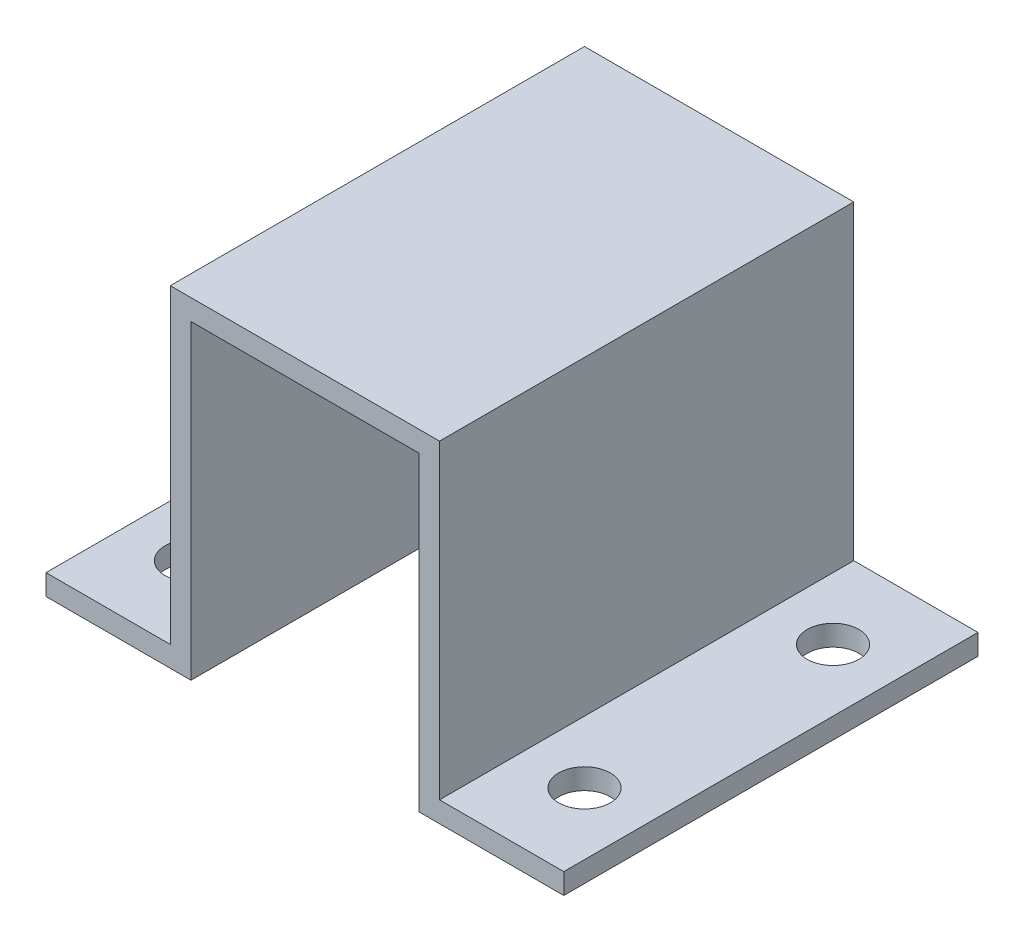
ISO-10303-21;
HEADER;
FILE_DESCRIPTION(('STEP AP214'),'2;1');
FILE_NAME('part.step','',(''),(''),'','','');
FILE_SCHEMA(('AUTOMOTIVE_DESIGN { 1 0 10303 214 1 1 1 1 }'));
ENDSEC;
DATA;
#1=APPLICATION_CONTEXT('core data for automotive mechanical design processes');
#2=APPLICATION_PROTOCOL_DEFINITION('international standard','automotive_design',2000,#1);
#3=PRODUCT_CONTEXT('',#1,'mechanical');
#4=PRODUCT('Part','Part','',(#3));
#5=PRODUCT_RELATED_PRODUCT_CATEGORY('part','',(#4));
#6=PRODUCT_DEFINITION_FORMATION('','',#4);
#7=PRODUCT_DEFINITION_CONTEXT('part definition',#1,'design');
#8=PRODUCT_DEFINITION('design','',#6,#7);
#9=PRODUCT_DEFINITION_SHAPE('','',#8);
#10=(LENGTH_UNIT() NAMED_UNIT(*) SI_UNIT(.MILLI.,.METRE.));
#11=(NAMED_UNIT(*) PLANE_ANGLE_UNIT() SI_UNIT($,.RADIAN.));
#12=(NAMED_UNIT(*) SI_UNIT($,.STERADIAN.) SOLID_ANGLE_UNIT());
#13=UNCERTAINTY_MEASURE_WITH_UNIT(LENGTH_MEASURE(1.E-05),#10,'distance_accuracy_value','');
#14=(GEOMETRIC_REPRESENTATION_CONTEXT(3) GLOBAL_UNCERTAINTY_ASSIGNED_CONTEXT((#13)) GLOBAL_UNIT_ASSIGNED_CONTEXT((#10,
#11,#12)) REPRESENTATION_CONTEXT('',''));
#15=CARTESIAN_POINT('',(0.,0.,0.));
#16=DIRECTION('',(0.,0.,1.));
#17=DIRECTION('',(1.,0.,0.));
#18=AXIS2_PLACEMENT_3D('',#15,#16,#17);
#19=CARTESIAN_POINT('',(0.,0.,50.8));
#20=DIRECTION('',(1.,0.,0.));
#21=DIRECTION('',(0.,0.,-1.));
#22=AXIS2_PLACEMENT_3D('',#19,#20,#21);
#23=PLANE('',#22);
#24=DIRECTION('',(0.,-1.,0.));
#25=VECTOR('',#24,1.);
#26=CARTESIAN_POINT('',(0.,0.,0.));
#27=LINE('',#26,#25);
#28=CARTESIAN_POINT('',(0.,2.54,0.));
#29=VERTEX_POINT('',#28);
#30=CARTESIAN_POINT('',(0.,0.,0.));
#31=VERTEX_POINT('',#30);
#32=EDGE_CURVE('E125',#29,#31,#27,.T.);
#33=ORIENTED_EDGE('',*,*,#32,.T.);
#34=DIRECTION('',(0.,0.,-1.));
#35=VECTOR('',#34,1.);
#36=CARTESIAN_POINT('',(0.,0.,50.8));
#37=LINE('',#36,#35);
#38=CARTESIAN_POINT('',(0.,0.,50.8));
#39=VERTEX_POINT('',#38);
#40=EDGE_CURVE('E11',#39,#31,#37,.T.);
#41=ORIENTED_EDGE('',*,*,#40,.F.);
#42=DIRECTION('',(0.,-1.,0.));
#43=VECTOR('',#42,1.);
#44=CARTESIAN_POINT('',(0.,0.,50.8));
#45=LINE('',#44,#43);
#46=CARTESIAN_POINT('',(0.,2.54,50.8));
#47=VERTEX_POINT('',#46);
#48=EDGE_CURVE('E139',#47,#39,#45,.T.);
#49=ORIENTED_EDGE('',*,*,#48,.F.);
#50=DIRECTION('',(0.,0.,-1.));
#51=VECTOR('',#50,1.);
#52=CARTESIAN_POINT('',(0.,2.54,50.8));
#53=LINE('',#52,#51);
#54=EDGE_CURVE('E121',#47,#29,#53,.T.);
#55=ORIENTED_EDGE('',*,*,#54,.T.);
#56=EDGE_LOOP('',(#33,#41,#49,#55));
#57=FACE_BOUND('',#56,.T.);
#58=ADVANCED_FACE('F33',(#57),#23,.F.);
#59=CARTESIAN_POINT('',(0.,0.,50.8));
#60=DIRECTION('',(0.,1.,0.));
#61=DIRECTION('',(0.,0.,1.));
#62=AXIS2_PLACEMENT_3D('',#59,#60,#61);
#63=PLANE('',#62);
#64=CARTESIAN_POINT('',(7.62,0.,40.64));
#65=DIRECTION('',(0.,1.,0.));
#66=DIRECTION('',(0.,0.,1.));
#67=AXIS2_PLACEMENT_3D('',#64,#65,#66);
#68=CIRCLE('',#67,3.175);
#69=CARTESIAN_POINT('',(7.62,0.,43.815));
#70=VERTEX_POINT('',#69);
#71=EDGE_CURVE('E252',#70,#70,#68,.F.);
#72=ORIENTED_EDGE('',*,*,#71,.F.);
#73=EDGE_LOOP('',(#72));
#74=FACE_BOUND('',#73,.T.);
#75=CARTESIAN_POINT('',(7.62,0.,10.16));
#76=DIRECTION('',(0.,1.,0.));
#77=DIRECTION('',(0.,0.,1.));
#78=AXIS2_PLACEMENT_3D('',#75,#76,#77);
#79=CIRCLE('',#78,3.175);
#80=CARTESIAN_POINT('',(7.62,0.,13.335));
#81=VERTEX_POINT('',#80);
#82=EDGE_CURVE('E240',#81,#81,#79,.F.);
#83=ORIENTED_EDGE('',*,*,#82,.F.);
#84=EDGE_LOOP('',(#83));
#85=FACE_BOUND('',#84,.T.);
#86=DIRECTION('',(1.,0.,0.));
#87=VECTOR('',#86,1.);
#88=CARTESIAN_POINT('',(0.,0.,0.));
#89=LINE('',#88,#87);
#90=CARTESIAN_POINT('',(17.78,0.,0.));
#91=VERTEX_POINT('',#90);
#92=EDGE_CURVE('E128',#31,#91,#89,.T.);
#93=ORIENTED_EDGE('',*,*,#92,.T.);
#94=DIRECTION('',(0.,0.,-1.));
#95=VECTOR('',#94,1.);
#96=CARTESIAN_POINT('',(17.78,0.,50.8));
#97=LINE('',#96,#95);
#98=CARTESIAN_POINT('',(17.78,0.,50.8));
#99=VERTEX_POINT('',#98);
#100=EDGE_CURVE('E41',#99,#91,#97,.T.);
#101=ORIENTED_EDGE('',*,*,#100,.F.);
#102=DIRECTION('',(1.,0.,0.));
#103=VECTOR('',#102,1.);
#104=CARTESIAN_POINT('',(0.,0.,50.8));
#105=LINE('',#104,#103);
#106=EDGE_CURVE('E87',#39,#99,#105,.T.);
#107=ORIENTED_EDGE('',*,*,#106,.F.);
#108=ORIENTED_EDGE('',*,*,#40,.T.);
#109=EDGE_LOOP('',(#93,#101,#107,#108));
#110=FACE_BOUND('',#109,.T.);
#111=ADVANCED_FACE('F295',(#74,#85,#110),#63,.F.);
#112=CARTESIAN_POINT('',(17.78,0.,50.8));
#113=DIRECTION('',(-1.,0.,0.));
#114=DIRECTION('',(0.,0.,1.));
#115=AXIS2_PLACEMENT_3D('',#112,#113,#114);
#116=PLANE('',#115);
#117=DIRECTION('',(0.,1.,0.));
#118=VECTOR('',#117,1.);
#119=CARTESIAN_POINT('',(17.78,0.,0.));
#120=LINE('',#119,#118);
#121=CARTESIAN_POINT('',(17.78,38.1,0.));
#122=VERTEX_POINT('',#121);
#123=EDGE_CURVE('E131',#91,#122,#120,.T.);
#124=ORIENTED_EDGE('',*,*,#123,.T.);
#125=DIRECTION('',(0.,0.,-1.));
#126=VECTOR('',#125,1.);
#127=CARTESIAN_POINT('',(17.78,38.1,50.8));
#128=LINE('',#127,#126);
#129=CARTESIAN_POINT('',(17.78,38.1,50.8));
#130=VERTEX_POINT('',#129);
#131=EDGE_CURVE('E116',#130,#122,#128,.T.);
#132=ORIENTED_EDGE('',*,*,#131,.F.);
#133=DIRECTION('',(0.,1.,0.));
#134=VECTOR('',#133,1.);
#135=CARTESIAN_POINT('',(17.78,0.,50.8));
#136=LINE('',#135,#134);
#137=EDGE_CURVE('E149',#99,#130,#136,.T.);
#138=ORIENTED_EDGE('',*,*,#137,.F.);
#139=ORIENTED_EDGE('',*,*,#100,.T.);
#140=EDGE_LOOP('',(#124,#132,#138,#139));
#141=FACE_BOUND('',#140,.T.);
#142=ADVANCED_FACE('F147',(#141),#116,.F.);
#143=CARTESIAN_POINT('',(17.78,38.1,50.8));
#144=DIRECTION('',(0.,1.,0.));
#145=DIRECTION('',(0.,0.,1.));
#146=AXIS2_PLACEMENT_3D('',#143,#144,#145);
#147=PLANE('',#146);
#148=DIRECTION('',(1.,0.,0.));
#149=VECTOR('',#148,1.);
#150=CARTESIAN_POINT('',(17.78,38.1,0.));
#151=LINE('',#150,#149);
#152=CARTESIAN_POINT('',(45.72,38.1,0.));
#153=VERTEX_POINT('',#152);
#154=EDGE_CURVE('E133',#122,#153,#151,.T.);
#155=ORIENTED_EDGE('',*,*,#154,.T.);
#156=DIRECTION('',(0.,0.,-1.));
#157=VECTOR('',#156,1.);
#158=CARTESIAN_POINT('',(45.72,38.1,50.8));
#159=LINE('',#158,#157);
#160=CARTESIAN_POINT('',(45.72,38.1,50.8));
#161=VERTEX_POINT('',#160);
#162=EDGE_CURVE('E165',#161,#153,#159,.T.);
#163=ORIENTED_EDGE('',*,*,#162,.F.);
#164=DIRECTION('',(1.,0.,0.));
#165=VECTOR('',#164,1.);
#166=CARTESIAN_POINT('',(17.78,38.1,50.8));
#167=LINE('',#166,#165);
#168=EDGE_CURVE('E110',#130,#161,#167,.T.);
#169=ORIENTED_EDGE('',*,*,#168,.F.);
#170=ORIENTED_EDGE('',*,*,#131,.T.);
#171=EDGE_LOOP('',(#155,#163,#169,#170));
#172=FACE_BOUND('',#171,.T.);
#173=ADVANCED_FACE('F162',(#172),#147,.F.);
#174=CARTESIAN_POINT('',(15.24,40.64,50.8));
#175=DIRECTION('',(0.,-1.,0.));
#176=DIRECTION('',(0.,0.,-1.));
#177=AXIS2_PLACEMENT_3D('',#174,#175,#176);
#178=PLANE('',#177);
#179=DIRECTION('',(-1.,0.,0.));
#180=VECTOR('',#179,1.);
#181=CARTESIAN_POINT('',(15.24,40.64,0.));
#182=LINE('',#181,#180);
#183=CARTESIAN_POINT('',(48.26,40.64,0.));
#184=VERTEX_POINT('',#183);
#185=CARTESIAN_POINT('',(15.24,40.64,0.));
#186=VERTEX_POINT('',#185);
#187=EDGE_CURVE('E115',#184,#186,#182,.T.);
#188=ORIENTED_EDGE('',*,*,#187,.T.);
#189=DIRECTION('',(0.,0.,-1.));
#190=VECTOR('',#189,1.);
#191=CARTESIAN_POINT('',(15.24,40.64,50.8));
#192=LINE('',#191,#190);
#193=CARTESIAN_POINT('',(15.24,40.64,50.8));
#194=VERTEX_POINT('',#193);
#195=EDGE_CURVE('E112',#194,#186,#192,.T.);
#196=ORIENTED_EDGE('',*,*,#195,.F.);
#197=DIRECTION('',(-1.,0.,0.));
#198=VECTOR('',#197,1.);
#199=CARTESIAN_POINT('',(15.24,40.64,50.8));
#200=LINE('',#199,#198);
#201=CARTESIAN_POINT('',(48.26,40.64,50.8));
#202=VERTEX_POINT('',#201);
#203=EDGE_CURVE('E98',#202,#194,#200,.T.);
#204=ORIENTED_EDGE('',*,*,#203,.F.);
#205=DIRECTION('',(0.,0.,-1.));
#206=VECTOR('',#205,1.);
#207=CARTESIAN_POINT('',(48.26,40.64,50.8));
#208=LINE('',#207,#206);
#209=EDGE_CURVE('E175',#202,#184,#208,.T.);
#210=ORIENTED_EDGE('',*,*,#209,.T.);
#211=EDGE_LOOP('',(#188,#196,#204,#210));
#212=FACE_BOUND('',#211,.T.);
#213=ADVANCED_FACE('F113',(#212),#178,.F.);
#214=CARTESIAN_POINT('',(15.24,2.54,50.8));
#215=DIRECTION('',(1.,0.,0.));
#216=DIRECTION('',(0.,0.,-1.));
#217=AXIS2_PLACEMENT_3D('',#214,#215,#216);
#218=PLANE('',#217);
#219=DIRECTION('',(0.,-1.,0.));
#220=VECTOR('',#219,1.);
#221=CARTESIAN_POINT('',(15.24,2.54,0.));
#222=LINE('',#221,#220);
#223=CARTESIAN_POINT('',(15.24,2.54,0.));
#224=VERTEX_POINT('',#223);
#225=EDGE_CURVE('E73',#186,#224,#222,.T.);
#226=ORIENTED_EDGE('',*,*,#225,.T.);
#227=DIRECTION('',(0.,0.,-1.));
#228=VECTOR('',#227,1.);
#229=CARTESIAN_POINT('',(15.24,2.54,50.8));
#230=LINE('',#229,#228);
#231=CARTESIAN_POINT('',(15.24,2.54,50.8));
#232=VERTEX_POINT('',#231);
#233=EDGE_CURVE('E117',#232,#224,#230,.T.);
#234=ORIENTED_EDGE('',*,*,#233,.F.);
#235=DIRECTION('',(0.,-1.,0.));
#236=VECTOR('',#235,1.);
#237=CARTESIAN_POINT('',(15.24,2.54,50.8));
#238=LINE('',#237,#236);
#239=EDGE_CURVE('E102',#194,#232,#238,.T.);
#240=ORIENTED_EDGE('',*,*,#239,.F.);
#241=ORIENTED_EDGE('',*,*,#195,.T.);
#242=EDGE_LOOP('',(#226,#234,#240,#241));
#243=FACE_BOUND('',#242,.T.);
#244=ADVANCED_FACE('F119',(#243),#218,.F.);
#245=CARTESIAN_POINT('',(0.,2.54,50.8));
#246=DIRECTION('',(0.,-1.,0.));
#247=DIRECTION('',(0.,0.,-1.));
#248=AXIS2_PLACEMENT_3D('',#245,#246,#247);
#249=PLANE('',#248);
#250=CARTESIAN_POINT('',(7.62,2.54,40.64));
#251=DIRECTION('',(0.,1.,0.));
#252=DIRECTION('',(0.,0.,1.));
#253=AXIS2_PLACEMENT_3D('',#250,#251,#252);
#254=CIRCLE('',#253,3.175);
#255=CARTESIAN_POINT('',(7.62,2.54,43.815));
#256=VERTEX_POINT('',#255);
#257=EDGE_CURVE('E255',#256,#256,#254,.T.);
#258=ORIENTED_EDGE('',*,*,#257,.F.);
#259=EDGE_LOOP('',(#258));
#260=FACE_BOUND('',#259,.T.);
#261=CARTESIAN_POINT('',(7.62,2.54,10.16));
#262=DIRECTION('',(0.,1.,0.));
#263=DIRECTION('',(0.,0.,1.));
#264=AXIS2_PLACEMENT_3D('',#261,#262,#263);
#265=CIRCLE('',#264,3.175);
#266=CARTESIAN_POINT('',(7.62,2.54,13.335));
#267=VERTEX_POINT('',#266);
#268=EDGE_CURVE('E249',#267,#267,#265,.T.);
#269=ORIENTED_EDGE('',*,*,#268,.F.);
#270=EDGE_LOOP('',(#269));
#271=FACE_BOUND('',#270,.T.);
#272=DIRECTION('',(-1.,0.,0.));
#273=VECTOR('',#272,1.);
#274=CARTESIAN_POINT('',(0.,2.54,0.));
#275=LINE('',#274,#273);
#276=EDGE_CURVE('E79',#224,#29,#275,.T.);
#277=ORIENTED_EDGE('',*,*,#276,.T.);
#278=ORIENTED_EDGE('',*,*,#54,.F.);
#279=DIRECTION('',(-1.,0.,0.));
#280=VECTOR('',#279,1.);
#281=CARTESIAN_POINT('',(0.,2.54,50.8));
#282=LINE('',#281,#280);
#283=EDGE_CURVE('E49',#232,#47,#282,.T.);
#284=ORIENTED_EDGE('',*,*,#283,.F.);
#285=ORIENTED_EDGE('',*,*,#233,.T.);
#286=EDGE_LOOP('',(#277,#278,#284,#285));
#287=FACE_BOUND('',#286,.T.);
#288=ADVANCED_FACE('F322',(#260,#271,#287),#249,.F.);
#289=CARTESIAN_POINT('',(0.,2.54,50.8));
#290=DIRECTION('',(0.,0.,-1.));
#291=DIRECTION('',(-1.,0.,0.));
#292=AXIS2_PLACEMENT_3D('',#289,#290,#291);
#293=PLANE('',#292);
#294=ORIENTED_EDGE('',*,*,#48,.T.);
#295=ORIENTED_EDGE('',*,*,#106,.T.);
#296=ORIENTED_EDGE('',*,*,#137,.T.);
#297=ORIENTED_EDGE('',*,*,#168,.T.);
#298=DIRECTION('',(0.,1.,0.));
#299=VECTOR('',#298,1.);
#300=CARTESIAN_POINT('',(45.72,0.,50.8));
#301=LINE('',#300,#299);
#302=CARTESIAN_POINT('',(45.72,0.,50.8));
#303=VERTEX_POINT('',#302);
#304=EDGE_CURVE('E174',#303,#161,#301,.T.);
#305=ORIENTED_EDGE('',*,*,#304,.F.);
#306=DIRECTION('',(-1.,0.,0.));
#307=VECTOR('',#306,1.);
#308=CARTESIAN_POINT('',(63.5,0.,50.8));
#309=LINE('',#308,#307);
#310=CARTESIAN_POINT('',(63.5,0.,50.8));
#311=VERTEX_POINT('',#310);
#312=EDGE_CURVE('E233',#311,#303,#309,.T.);
#313=ORIENTED_EDGE('',*,*,#312,.F.);
#314=DIRECTION('',(0.,-1.,0.));
#315=VECTOR('',#314,1.);
#316=CARTESIAN_POINT('',(63.5,0.,50.8));
#317=LINE('',#316,#315);
#318=CARTESIAN_POINT('',(63.5,2.54,50.8));
#319=VERTEX_POINT('',#318);
#320=EDGE_CURVE('E229',#319,#311,#317,.T.);
#321=ORIENTED_EDGE('',*,*,#320,.F.);
#322=DIRECTION('',(1.,0.,0.));
#323=VECTOR('',#322,1.);
#324=CARTESIAN_POINT('',(63.5,2.54,50.8));
#325=LINE('',#324,#323);
#326=CARTESIAN_POINT('',(48.26,2.54,50.8));
#327=VERTEX_POINT('',#326);
#328=EDGE_CURVE('E223',#327,#319,#325,.T.);
#329=ORIENTED_EDGE('',*,*,#328,.F.);
#330=DIRECTION('',(0.,-1.,0.));
#331=VECTOR('',#330,1.);
#332=CARTESIAN_POINT('',(48.26,2.54,50.8));
#333=LINE('',#332,#331);
#334=EDGE_CURVE('E106',#202,#327,#333,.T.);
#335=ORIENTED_EDGE('',*,*,#334,.F.);
#336=ORIENTED_EDGE('',*,*,#203,.T.);
#337=ORIENTED_EDGE('',*,*,#239,.T.);
#338=ORIENTED_EDGE('',*,*,#283,.T.);
#339=EDGE_LOOP('',(#294,#295,#296,#297,#305,#313,#321,#329,#335,#336,#337,#338));
#340=FACE_BOUND('',#339,.T.);
#341=ADVANCED_FACE('F100',(#340),#293,.F.);
#342=CARTESIAN_POINT('',(0.,2.54,0.));
#343=DIRECTION('',(0.,0.,-1.));
#344=DIRECTION('',(-1.,0.,0.));
#345=AXIS2_PLACEMENT_3D('',#342,#343,#344);
#346=PLANE('',#345);
#347=ORIENTED_EDGE('',*,*,#32,.F.);
#348=ORIENTED_EDGE('',*,*,#276,.F.);
#349=ORIENTED_EDGE('',*,*,#225,.F.);
#350=ORIENTED_EDGE('',*,*,#187,.F.);
#351=DIRECTION('',(0.,-1.,0.));
#352=VECTOR('',#351,1.);
#353=CARTESIAN_POINT('',(48.26,2.54,0.));
#354=LINE('',#353,#352);
#355=CARTESIAN_POINT('',(48.26,2.54,0.));
#356=VERTEX_POINT('',#355);
#357=EDGE_CURVE('E242',#184,#356,#354,.T.);
#358=ORIENTED_EDGE('',*,*,#357,.T.);
#359=DIRECTION('',(1.,0.,0.));
#360=VECTOR('',#359,1.);
#361=CARTESIAN_POINT('',(63.5,2.54,0.));
#362=LINE('',#361,#360);
#363=CARTESIAN_POINT('',(63.5,2.54,0.));
#364=VERTEX_POINT('',#363);
#365=EDGE_CURVE('E225',#356,#364,#362,.T.);
#366=ORIENTED_EDGE('',*,*,#365,.T.);
#367=DIRECTION('',(0.,-1.,0.));
#368=VECTOR('',#367,1.);
#369=CARTESIAN_POINT('',(63.5,0.,0.));
#370=LINE('',#369,#368);
#371=CARTESIAN_POINT('',(63.5,0.,0.));
#372=VERTEX_POINT('',#371);
#373=EDGE_CURVE('E238',#364,#372,#370,.T.);
#374=ORIENTED_EDGE('',*,*,#373,.T.);
#375=DIRECTION('',(-1.,0.,0.));
#376=VECTOR('',#375,1.);
#377=CARTESIAN_POINT('',(63.5,0.,0.));
#378=LINE('',#377,#376);
#379=CARTESIAN_POINT('',(45.72,0.,0.));
#380=VERTEX_POINT('',#379);
#381=EDGE_CURVE('E245',#372,#380,#378,.T.);
#382=ORIENTED_EDGE('',*,*,#381,.T.);
#383=DIRECTION('',(0.,1.,0.));
#384=VECTOR('',#383,1.);
#385=CARTESIAN_POINT('',(45.72,0.,0.));
#386=LINE('',#385,#384);
#387=EDGE_CURVE('E158',#380,#153,#386,.T.);
#388=ORIENTED_EDGE('',*,*,#387,.T.);
#389=ORIENTED_EDGE('',*,*,#154,.F.);
#390=ORIENTED_EDGE('',*,*,#123,.F.);
#391=ORIENTED_EDGE('',*,*,#92,.F.);
#392=EDGE_LOOP('',(#347,#348,#349,#350,#358,#366,#374,#382,#388,#389,#390,#391));
#393=FACE_BOUND('',#392,.T.);
#394=ADVANCED_FACE('F153',(#393),#346,.T.);
#395=CARTESIAN_POINT('',(63.5,0.,50.8));
#396=DIRECTION('',(1.,0.,0.));
#397=DIRECTION('',(0.,0.,-1.));
#398=AXIS2_PLACEMENT_3D('',#395,#396,#397);
#399=PLANE('',#398);
#400=ORIENTED_EDGE('',*,*,#373,.F.);
#401=DIRECTION('',(0.,0.,-1.));
#402=VECTOR('',#401,1.);
#403=CARTESIAN_POINT('',(63.5,2.54,50.8));
#404=LINE('',#403,#402);
#405=EDGE_CURVE('E129',#319,#364,#404,.T.);
#406=ORIENTED_EDGE('',*,*,#405,.F.);
#407=ORIENTED_EDGE('',*,*,#320,.T.);
#408=DIRECTION('',(0.,0.,-1.));
#409=VECTOR('',#408,1.);
#410=CARTESIAN_POINT('',(63.5,0.,50.8));
#411=LINE('',#410,#409);
#412=EDGE_CURVE('E181',#311,#372,#411,.T.);
#413=ORIENTED_EDGE('',*,*,#412,.T.);
#414=EDGE_LOOP('',(#400,#406,#407,#413));
#415=FACE_BOUND('',#414,.T.);
#416=ADVANCED_FACE('F275',(#415),#399,.T.);
#417=CARTESIAN_POINT('',(63.5,2.54,50.8));
#418=DIRECTION('',(0.,1.,0.));
#419=DIRECTION('',(0.,0.,1.));
#420=AXIS2_PLACEMENT_3D('',#417,#418,#419);
#421=PLANE('',#420);
#422=CARTESIAN_POINT('',(55.88,2.54,10.16));
#423=DIRECTION('',(0.,1.,0.));
#424=DIRECTION('',(0.,0.,1.));
#425=AXIS2_PLACEMENT_3D('',#422,#423,#424);
#426=CIRCLE('',#425,3.175);
#427=CARTESIAN_POINT('',(55.88,2.54,13.335));
#428=VERTEX_POINT('',#427);
#429=EDGE_CURVE('E262',#428,#428,#426,.T.);
#430=ORIENTED_EDGE('',*,*,#429,.F.);
#431=EDGE_LOOP('',(#430));
#432=FACE_BOUND('',#431,.T.);
#433=CARTESIAN_POINT('',(55.88,2.54,40.64));
#434=DIRECTION('',(0.,1.,0.));
#435=DIRECTION('',(0.,0.,1.));
#436=AXIS2_PLACEMENT_3D('',#433,#434,#435);
#437=CIRCLE('',#436,3.175);
#438=CARTESIAN_POINT('',(55.88,2.54,43.815));
#439=VERTEX_POINT('',#438);
#440=EDGE_CURVE('E258',#439,#439,#437,.T.);
#441=ORIENTED_EDGE('',*,*,#440,.F.);
#442=EDGE_LOOP('',(#441));
#443=FACE_BOUND('',#442,.T.);
#444=ORIENTED_EDGE('',*,*,#365,.F.);
#445=DIRECTION('',(0.,0.,-1.));
#446=VECTOR('',#445,1.);
#447=CARTESIAN_POINT('',(48.26,2.54,50.8));
#448=LINE('',#447,#446);
#449=EDGE_CURVE('E178',#327,#356,#448,.T.);
#450=ORIENTED_EDGE('',*,*,#449,.F.);
#451=ORIENTED_EDGE('',*,*,#328,.T.);
#452=ORIENTED_EDGE('',*,*,#405,.T.);
#453=EDGE_LOOP('',(#444,#450,#451,#452));
#454=FACE_BOUND('',#453,.T.);
#455=ADVANCED_FACE('F222',(#432,#443,#454),#421,.T.);
#456=CARTESIAN_POINT('',(48.26,2.54,50.8));
#457=DIRECTION('',(1.,0.,0.));
#458=DIRECTION('',(0.,0.,-1.));
#459=AXIS2_PLACEMENT_3D('',#456,#457,#458);
#460=PLANE('',#459);
#461=ORIENTED_EDGE('',*,*,#357,.F.);
#462=ORIENTED_EDGE('',*,*,#209,.F.);
#463=ORIENTED_EDGE('',*,*,#334,.T.);
#464=ORIENTED_EDGE('',*,*,#449,.T.);
#465=EDGE_LOOP('',(#461,#462,#463,#464));
#466=FACE_BOUND('',#465,.T.);
#467=ADVANCED_FACE('F231',(#466),#460,.T.);
#468=CARTESIAN_POINT('',(45.72,0.,50.8));
#469=DIRECTION('',(-1.,0.,0.));
#470=DIRECTION('',(0.,0.,1.));
#471=AXIS2_PLACEMENT_3D('',#468,#469,#470);
#472=PLANE('',#471);
#473=ORIENTED_EDGE('',*,*,#387,.F.);
#474=DIRECTION('',(0.,0.,-1.));
#475=VECTOR('',#474,1.);
#476=CARTESIAN_POINT('',(45.72,0.,50.8));
#477=LINE('',#476,#475);
#478=EDGE_CURVE('E176',#303,#380,#477,.T.);
#479=ORIENTED_EDGE('',*,*,#478,.F.);
#480=ORIENTED_EDGE('',*,*,#304,.T.);
#481=ORIENTED_EDGE('',*,*,#162,.T.);
#482=EDGE_LOOP('',(#473,#479,#480,#481));
#483=FACE_BOUND('',#482,.T.);
#484=ADVANCED_FACE('F171',(#483),#472,.T.);
#485=CARTESIAN_POINT('',(63.5,0.,50.8));
#486=DIRECTION('',(0.,-1.,0.));
#487=DIRECTION('',(0.,0.,-1.));
#488=AXIS2_PLACEMENT_3D('',#485,#486,#487);
#489=PLANE('',#488);
#490=CARTESIAN_POINT('',(55.88,0.,10.16));
#491=DIRECTION('',(0.,-1.,0.));
#492=DIRECTION('',(0.,0.,-1.));
#493=AXIS2_PLACEMENT_3D('',#490,#491,#492);
#494=CIRCLE('',#493,3.175);
#495=CARTESIAN_POINT('',(55.88,0.,6.985));
#496=VERTEX_POINT('',#495);
#497=EDGE_CURVE('E265',#496,#496,#494,.F.);
#498=ORIENTED_EDGE('',*,*,#497,.T.);
#499=EDGE_LOOP('',(#498));
#500=FACE_BOUND('',#499,.T.);
#501=CARTESIAN_POINT('',(55.88,0.,40.64));
#502=DIRECTION('',(0.,-1.,0.));
#503=DIRECTION('',(0.,0.,-1.));
#504=AXIS2_PLACEMENT_3D('',#501,#502,#503);
#505=CIRCLE('',#504,3.175);
#506=CARTESIAN_POINT('',(55.88,0.,37.465));
#507=VERTEX_POINT('',#506);
#508=EDGE_CURVE('E259',#507,#507,#505,.F.);
#509=ORIENTED_EDGE('',*,*,#508,.T.);
#510=EDGE_LOOP('',(#509));
#511=FACE_BOUND('',#510,.T.);
#512=ORIENTED_EDGE('',*,*,#381,.F.);
#513=ORIENTED_EDGE('',*,*,#412,.F.);
#514=ORIENTED_EDGE('',*,*,#312,.T.);
#515=ORIENTED_EDGE('',*,*,#478,.T.);
#516=EDGE_LOOP('',(#512,#513,#514,#515));
#517=FACE_BOUND('',#516,.T.);
#518=ADVANCED_FACE('F303',(#500,#511,#517),#489,.T.);
#519=CARTESIAN_POINT('',(7.62,-0.00100000000000013,10.16));
#520=DIRECTION('',(0.,1.,0.));
#521=DIRECTION('',(0.,0.,1.));
#522=AXIS2_PLACEMENT_3D('',#519,#520,#521);
#523=CYLINDRICAL_SURFACE('',#522,3.175);
#524=ORIENTED_EDGE('',*,*,#268,.T.);
#525=EDGE_LOOP('',(#524));
#526=FACE_BOUND('',#525,.T.);
#527=ORIENTED_EDGE('',*,*,#82,.T.);
#528=EDGE_LOOP('',(#527));
#529=FACE_BOUND('',#528,.T.);
#530=ADVANCED_FACE('F290',(#526,#529),#523,.F.);
#531=CARTESIAN_POINT('',(7.62,-0.00100000000000013,40.64));
#532=DIRECTION('',(0.,1.,0.));
#533=DIRECTION('',(0.,0.,1.));
#534=AXIS2_PLACEMENT_3D('',#531,#532,#533);
#535=CYLINDRICAL_SURFACE('',#534,3.175);
#536=ORIENTED_EDGE('',*,*,#257,.T.);
#537=EDGE_LOOP('',(#536));
#538=FACE_BOUND('',#537,.T.);
#539=ORIENTED_EDGE('',*,*,#71,.T.);
#540=EDGE_LOOP('',(#539));
#541=FACE_BOUND('',#540,.T.);
#542=ADVANCED_FACE('F281',(#538,#541),#535,.F.);
#543=CARTESIAN_POINT('',(55.88,-0.00100000000000013,40.64));
#544=DIRECTION('',(0.,1.,0.));
#545=DIRECTION('',(0.,0.,1.));
#546=AXIS2_PLACEMENT_3D('',#543,#544,#545);
#547=CYLINDRICAL_SURFACE('',#546,3.175);
#548=ORIENTED_EDGE('',*,*,#508,.F.);
#549=EDGE_LOOP('',(#548));
#550=FACE_BOUND('',#549,.T.);
#551=ORIENTED_EDGE('',*,*,#440,.T.);
#552=EDGE_LOOP('',(#551));
#553=FACE_BOUND('',#552,.T.);
#554=ADVANCED_FACE('F279',(#550,#553),#547,.F.);
#555=CARTESIAN_POINT('',(55.88,-0.00100000000000013,10.16));
#556=DIRECTION('',(0.,1.,0.));
#557=DIRECTION('',(0.,0.,1.));
#558=AXIS2_PLACEMENT_3D('',#555,#556,#557);
#559=CYLINDRICAL_SURFACE('',#558,3.175);
#560=ORIENTED_EDGE('',*,*,#497,.F.);
#561=EDGE_LOOP('',(#560));
#562=FACE_BOUND('',#561,.T.);
#563=ORIENTED_EDGE('',*,*,#429,.T.);
#564=EDGE_LOOP('',(#563));
#565=FACE_BOUND('',#564,.T.);
#566=ADVANCED_FACE('F271',(#562,#565),#559,.F.);
#567=CLOSED_SHELL('',(#58,#111,#142,#173,#213,#244,#288,#341,#394,#416,#455,#467,#484,#518,#530,
#542,#554,#566));
#568=MANIFOLD_SOLID_BREP('B2',#567);
#569=ADVANCED_BREP_SHAPE_REPRESENTATION('',(#18,#568),#14);
#570=SHAPE_DEFINITION_REPRESENTATION(#9,#569);
ENDSEC;
END-ISO-10303-21;
